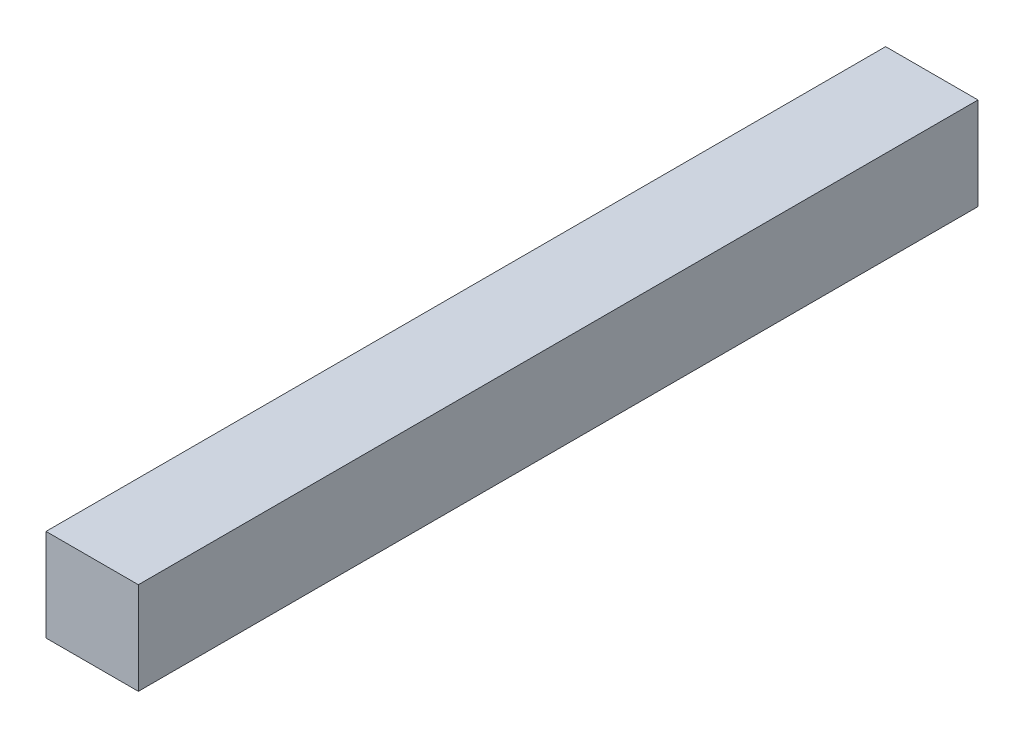
ISO-10303-21;
HEADER;
FILE_DESCRIPTION(('STEP AP214'),'2;1');
FILE_NAME('part.step','',(''),(''),'','','');
FILE_SCHEMA(('AUTOMOTIVE_DESIGN { 1 0 10303 214 1 1 1 1 }'));
ENDSEC;
DATA;
#1=APPLICATION_CONTEXT('core data for automotive mechanical design processes');
#2=APPLICATION_PROTOCOL_DEFINITION('international standard','automotive_design',2000,#1);
#3=PRODUCT_CONTEXT('',#1,'mechanical');
#4=PRODUCT('Part','Part','',(#3));
#5=PRODUCT_RELATED_PRODUCT_CATEGORY('part','',(#4));
#6=PRODUCT_DEFINITION_FORMATION('','',#4);
#7=PRODUCT_DEFINITION_CONTEXT('part definition',#1,'design');
#8=PRODUCT_DEFINITION('design','',#6,#7);
#9=PRODUCT_DEFINITION_SHAPE('','',#8);
#10=(LENGTH_UNIT() NAMED_UNIT(*) SI_UNIT(.MILLI.,.METRE.));
#11=(NAMED_UNIT(*) PLANE_ANGLE_UNIT() SI_UNIT($,.RADIAN.));
#12=(NAMED_UNIT(*) SI_UNIT($,.STERADIAN.) SOLID_ANGLE_UNIT());
#13=UNCERTAINTY_MEASURE_WITH_UNIT(LENGTH_MEASURE(1.E-05),#10,'distance_accuracy_value','');
#14=(GEOMETRIC_REPRESENTATION_CONTEXT(3) GLOBAL_UNCERTAINTY_ASSIGNED_CONTEXT((#13)) GLOBAL_UNIT_ASSIGNED_CONTEXT((#10,
#11,#12)) REPRESENTATION_CONTEXT('',''));
#15=CARTESIAN_POINT('',(0.,0.,0.));
#16=DIRECTION('',(0.,0.,1.));
#17=DIRECTION('',(1.,0.,0.));
#18=AXIS2_PLACEMENT_3D('',#15,#16,#17);
#19=CARTESIAN_POINT('',(0.,0.,-200.));
#20=DIRECTION('',(-1.,0.,0.));
#21=DIRECTION('',(0.,0.,1.));
#22=AXIS2_PLACEMENT_3D('',#19,#20,#21);
#23=PLANE('',#22);
#24=DIRECTION('',(0.,-1.,0.));
#25=VECTOR('',#24,1.);
#26=CARTESIAN_POINT('',(0.,0.,0.));
#27=LINE('',#26,#25);
#28=CARTESIAN_POINT('',(0.,22.,0.));
#29=VERTEX_POINT('',#28);
#30=CARTESIAN_POINT('',(0.,0.,0.));
#31=VERTEX_POINT('',#30);
#32=EDGE_CURVE('E95',#29,#31,#27,.T.);
#33=ORIENTED_EDGE('',*,*,#32,.F.);
#34=DIRECTION('',(0.,0.,1.));
#35=VECTOR('',#34,1.);
#36=CARTESIAN_POINT('',(0.,22.,-200.));
#37=LINE('',#36,#35);
#38=CARTESIAN_POINT('',(0.,22.,-200.));
#39=VERTEX_POINT('',#38);
#40=EDGE_CURVE('E11',#39,#29,#37,.T.);
#41=ORIENTED_EDGE('',*,*,#40,.F.);
#42=DIRECTION('',(0.,-1.,0.));
#43=VECTOR('',#42,1.);
#44=CARTESIAN_POINT('',(0.,0.,-200.));
#45=LINE('',#44,#43);
#46=CARTESIAN_POINT('',(0.,0.,-200.));
#47=VERTEX_POINT('',#46);
#48=EDGE_CURVE('E89',#39,#47,#45,.T.);
#49=ORIENTED_EDGE('',*,*,#48,.T.);
#50=DIRECTION('',(0.,0.,1.));
#51=VECTOR('',#50,1.);
#52=CARTESIAN_POINT('',(0.,0.,-200.));
#53=LINE('',#52,#51);
#54=EDGE_CURVE('E34',#47,#31,#53,.T.);
#55=ORIENTED_EDGE('',*,*,#54,.T.);
#56=EDGE_LOOP('',(#33,#41,#49,#55));
#57=FACE_BOUND('',#56,.T.);
#58=ADVANCED_FACE('F31',(#57),#23,.T.);
#59=CARTESIAN_POINT('',(0.,22.,-200.));
#60=DIRECTION('',(0.,1.,0.));
#61=DIRECTION('',(0.,0.,1.));
#62=AXIS2_PLACEMENT_3D('',#59,#60,#61);
#63=PLANE('',#62);
#64=DIRECTION('',(-1.,0.,0.));
#65=VECTOR('',#64,1.);
#66=CARTESIAN_POINT('',(0.,22.,0.));
#67=LINE('',#66,#65);
#68=CARTESIAN_POINT('',(22.,22.,0.));
#69=VERTEX_POINT('',#68);
#70=EDGE_CURVE('E91',#69,#29,#67,.T.);
#71=ORIENTED_EDGE('',*,*,#70,.F.);
#72=DIRECTION('',(0.,0.,1.));
#73=VECTOR('',#72,1.);
#74=CARTESIAN_POINT('',(22.,22.,-200.));
#75=LINE('',#74,#73);
#76=CARTESIAN_POINT('',(22.,22.,-200.));
#77=VERTEX_POINT('',#76);
#78=EDGE_CURVE('E40',#77,#69,#75,.T.);
#79=ORIENTED_EDGE('',*,*,#78,.F.);
#80=DIRECTION('',(-1.,0.,0.));
#81=VECTOR('',#80,1.);
#82=CARTESIAN_POINT('',(0.,22.,-200.));
#83=LINE('',#82,#81);
#84=EDGE_CURVE('E86',#77,#39,#83,.T.);
#85=ORIENTED_EDGE('',*,*,#84,.T.);
#86=ORIENTED_EDGE('',*,*,#40,.T.);
#87=EDGE_LOOP('',(#71,#79,#85,#86));
#88=FACE_BOUND('',#87,.T.);
#89=ADVANCED_FACE('F105',(#88),#63,.T.);
#90=CARTESIAN_POINT('',(22.,0.,-200.));
#91=DIRECTION('',(1.,0.,0.));
#92=DIRECTION('',(0.,0.,-1.));
#93=AXIS2_PLACEMENT_3D('',#90,#91,#92);
#94=PLANE('',#93);
#95=DIRECTION('',(0.,1.,0.));
#96=VECTOR('',#95,1.);
#97=CARTESIAN_POINT('',(22.,0.,0.));
#98=LINE('',#97,#96);
#99=CARTESIAN_POINT('',(22.,0.,0.));
#100=VERTEX_POINT('',#99);
#101=EDGE_CURVE('E81',#100,#69,#98,.T.);
#102=ORIENTED_EDGE('',*,*,#101,.F.);
#103=DIRECTION('',(0.,0.,1.));
#104=VECTOR('',#103,1.);
#105=CARTESIAN_POINT('',(22.,0.,-200.));
#106=LINE('',#105,#104);
#107=CARTESIAN_POINT('',(22.,0.,-200.));
#108=VERTEX_POINT('',#107);
#109=EDGE_CURVE('E76',#108,#100,#106,.T.);
#110=ORIENTED_EDGE('',*,*,#109,.F.);
#111=DIRECTION('',(0.,1.,0.));
#112=VECTOR('',#111,1.);
#113=CARTESIAN_POINT('',(22.,0.,-200.));
#114=LINE('',#113,#112);
#115=EDGE_CURVE('E79',#108,#77,#114,.T.);
#116=ORIENTED_EDGE('',*,*,#115,.T.);
#117=ORIENTED_EDGE('',*,*,#78,.T.);
#118=EDGE_LOOP('',(#102,#110,#116,#117));
#119=FACE_BOUND('',#118,.T.);
#120=ADVANCED_FACE('F78',(#119),#94,.T.);
#121=CARTESIAN_POINT('',(0.,0.,-200.));
#122=DIRECTION('',(0.,-1.,0.));
#123=DIRECTION('',(0.,0.,-1.));
#124=AXIS2_PLACEMENT_3D('',#121,#122,#123);
#125=PLANE('',#124);
#126=DIRECTION('',(1.,0.,0.));
#127=VECTOR('',#126,1.);
#128=CARTESIAN_POINT('',(0.,0.,0.));
#129=LINE('',#128,#127);
#130=EDGE_CURVE('E98',#31,#100,#129,.T.);
#131=ORIENTED_EDGE('',*,*,#130,.F.);
#132=ORIENTED_EDGE('',*,*,#54,.F.);
#133=DIRECTION('',(1.,0.,0.));
#134=VECTOR('',#133,1.);
#135=CARTESIAN_POINT('',(0.,0.,-200.));
#136=LINE('',#135,#134);
#137=EDGE_CURVE('E85',#47,#108,#136,.T.);
#138=ORIENTED_EDGE('',*,*,#137,.T.);
#139=ORIENTED_EDGE('',*,*,#109,.T.);
#140=EDGE_LOOP('',(#131,#132,#138,#139));
#141=FACE_BOUND('',#140,.T.);
#142=ADVANCED_FACE('F88',(#141),#125,.T.);
#143=CARTESIAN_POINT('',(0.,22.,-200.));
#144=DIRECTION('',(0.,0.,-1.));
#145=DIRECTION('',(-1.,0.,0.));
#146=AXIS2_PLACEMENT_3D('',#143,#144,#145);
#147=PLANE('',#146);
#148=ORIENTED_EDGE('',*,*,#48,.F.);
#149=ORIENTED_EDGE('',*,*,#84,.F.);
#150=ORIENTED_EDGE('',*,*,#115,.F.);
#151=ORIENTED_EDGE('',*,*,#137,.F.);
#152=EDGE_LOOP('',(#148,#149,#150,#151));
#153=FACE_BOUND('',#152,.T.);
#154=ADVANCED_FACE('F84',(#153),#147,.T.);
#155=CARTESIAN_POINT('',(0.,22.,0.));
#156=DIRECTION('',(0.,0.,-1.));
#157=DIRECTION('',(-1.,0.,0.));
#158=AXIS2_PLACEMENT_3D('',#155,#156,#157);
#159=PLANE('',#158);
#160=ORIENTED_EDGE('',*,*,#32,.T.);
#161=ORIENTED_EDGE('',*,*,#130,.T.);
#162=ORIENTED_EDGE('',*,*,#101,.T.);
#163=ORIENTED_EDGE('',*,*,#70,.T.);
#164=EDGE_LOOP('',(#160,#161,#162,#163));
#165=FACE_BOUND('',#164,.T.);
#166=ADVANCED_FACE('F104',(#165),#159,.F.);
#167=CLOSED_SHELL('',(#58,#89,#120,#142,#154,#166));
#168=MANIFOLD_SOLID_BREP('B2',#167);
#169=ADVANCED_BREP_SHAPE_REPRESENTATION('',(#18,#168),#14);
#170=SHAPE_DEFINITION_REPRESENTATION(#9,#169);
ENDSEC;
END-ISO-10303-21;
